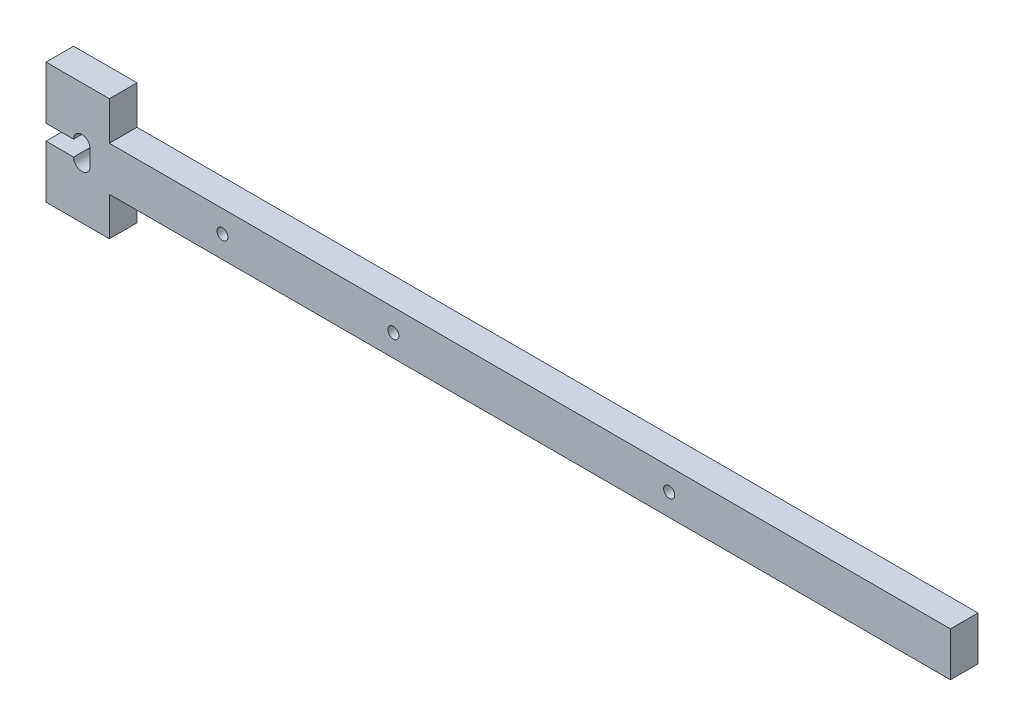
ISO-10303-21;
HEADER;
FILE_DESCRIPTION(('STEP AP214'),'2;1');
FILE_NAME('part.step','',(''),(''),'','','');
FILE_SCHEMA(('AUTOMOTIVE_DESIGN { 1 0 10303 214 1 1 1 1 }'));
ENDSEC;
DATA;
#1=APPLICATION_CONTEXT('core data for automotive mechanical design processes');
#2=APPLICATION_PROTOCOL_DEFINITION('international standard','automotive_design',2000,#1);
#3=PRODUCT_CONTEXT('',#1,'mechanical');
#4=PRODUCT('Part','Part','',(#3));
#5=PRODUCT_RELATED_PRODUCT_CATEGORY('part','',(#4));
#6=PRODUCT_DEFINITION_FORMATION('','',#4);
#7=PRODUCT_DEFINITION_CONTEXT('part definition',#1,'design');
#8=PRODUCT_DEFINITION('design','',#6,#7);
#9=PRODUCT_DEFINITION_SHAPE('','',#8);
#10=(LENGTH_UNIT() NAMED_UNIT(*) SI_UNIT(.MILLI.,.METRE.));
#11=(NAMED_UNIT(*) PLANE_ANGLE_UNIT() SI_UNIT($,.RADIAN.));
#12=(NAMED_UNIT(*) SI_UNIT($,.STERADIAN.) SOLID_ANGLE_UNIT());
#13=UNCERTAINTY_MEASURE_WITH_UNIT(LENGTH_MEASURE(1.E-05),#10,'distance_accuracy_value','');
#14=(GEOMETRIC_REPRESENTATION_CONTEXT(3) GLOBAL_UNCERTAINTY_ASSIGNED_CONTEXT((#13)) GLOBAL_UNIT_ASSIGNED_CONTEXT((#10,
#11,#12)) REPRESENTATION_CONTEXT('',''));
#15=CARTESIAN_POINT('',(0.,0.,0.));
#16=DIRECTION('',(0.,0.,1.));
#17=DIRECTION('',(1.,0.,0.));
#18=AXIS2_PLACEMENT_3D('',#15,#16,#17);
#19=CARTESIAN_POINT('',(2568.66153197921,4659.23440091256,5.));
#20=DIRECTION('',(0.,0.,-1.));
#21=DIRECTION('',(-1.,0.,0.));
#22=AXIS2_PLACEMENT_3D('',#19,#20,#21);
#23=CYLINDRICAL_SURFACE('',#22,1.50000000000006);
#24=CARTESIAN_POINT('',(2568.66153197921,4659.23440091256,0.));
#25=DIRECTION('',(0.,0.,1.));
#26=DIRECTION('',(1.,0.,0.));
#27=AXIS2_PLACEMENT_3D('',#24,#25,#26);
#28=CIRCLE('',#27,1.50000000000006);
#29=CARTESIAN_POINT('',(2567.16153197921,4659.23440091256,0.));
#30=VERTEX_POINT('',#29);
#31=CARTESIAN_POINT('',(2570.16153197921,4659.23440091256,0.));
#32=VERTEX_POINT('',#31);
#33=EDGE_CURVE('E174',#30,#32,#28,.T.);
#34=ORIENTED_EDGE('',*,*,#33,.F.);
#35=DIRECTION('',(0.,0.,-1.));
#36=VECTOR('',#35,1.);
#37=CARTESIAN_POINT('',(2567.16153197921,4659.23440091256,5.));
#38=LINE('',#37,#36);
#39=CARTESIAN_POINT('',(2567.16153197921,4659.23440091256,5.));
#40=VERTEX_POINT('',#39);
#41=EDGE_CURVE('E11',#40,#30,#38,.T.);
#42=ORIENTED_EDGE('',*,*,#41,.F.);
#43=CARTESIAN_POINT('',(2568.66153197921,4659.23440091256,5.));
#44=DIRECTION('',(0.,0.,1.));
#45=DIRECTION('',(1.,0.,0.));
#46=AXIS2_PLACEMENT_3D('',#43,#44,#45);
#47=CIRCLE('',#46,1.50000000000006);
#48=CARTESIAN_POINT('',(2570.16153197921,4659.23440091256,5.));
#49=VERTEX_POINT('',#48);
#50=EDGE_CURVE('E257',#40,#49,#47,.T.);
#51=ORIENTED_EDGE('',*,*,#50,.T.);
#52=DIRECTION('',(0.,0.,-1.));
#53=VECTOR('',#52,1.);
#54=CARTESIAN_POINT('',(2570.16153197921,4659.23440091256,5.));
#55=LINE('',#54,#53);
#56=EDGE_CURVE('E52',#49,#32,#55,.T.);
#57=ORIENTED_EDGE('',*,*,#56,.T.);
#58=EDGE_LOOP('',(#34,#42,#51,#57));
#59=FACE_BOUND('',#58,.T.);
#60=ADVANCED_FACE('F35',(#59),#23,.F.);
#61=CARTESIAN_POINT('',(0.,4659.23440091256,5.));
#62=DIRECTION('',(0.,1.,0.));
#63=DIRECTION('',(0.,0.,1.));
#64=AXIS2_PLACEMENT_3D('',#61,#62,#63);
#65=PLANE('',#64);
#66=DIRECTION('',(1.,0.,0.));
#67=VECTOR('',#66,1.);
#68=CARTESIAN_POINT('',(0.,4659.23440091256,0.));
#69=LINE('',#68,#67);
#70=CARTESIAN_POINT('',(2562.16153197921,4659.23440091256,0.));
#71=VERTEX_POINT('',#70);
#72=EDGE_CURVE('E176',#71,#30,#69,.T.);
#73=ORIENTED_EDGE('',*,*,#72,.F.);
#74=DIRECTION('',(0.,0.,-1.));
#75=VECTOR('',#74,1.);
#76=CARTESIAN_POINT('',(2562.16153197921,4659.23440091256,5.));
#77=LINE('',#76,#75);
#78=CARTESIAN_POINT('',(2562.16153197921,4659.23440091256,5.));
#79=VERTEX_POINT('',#78);
#80=EDGE_CURVE('E44',#79,#71,#77,.T.);
#81=ORIENTED_EDGE('',*,*,#80,.F.);
#82=DIRECTION('',(1.,0.,0.));
#83=VECTOR('',#82,1.);
#84=CARTESIAN_POINT('',(0.,4659.23440091256,5.));
#85=LINE('',#84,#83);
#86=EDGE_CURVE('E255',#79,#40,#85,.T.);
#87=ORIENTED_EDGE('',*,*,#86,.T.);
#88=ORIENTED_EDGE('',*,*,#41,.T.);
#89=EDGE_LOOP('',(#73,#81,#87,#88));
#90=FACE_BOUND('',#89,.T.);
#91=ADVANCED_FACE('F242',(#90),#65,.T.);
#92=CARTESIAN_POINT('',(2562.16153197921,0.,5.));
#93=DIRECTION('',(-1.,0.,0.));
#94=DIRECTION('',(0.,0.,1.));
#95=AXIS2_PLACEMENT_3D('',#92,#93,#94);
#96=PLANE('',#95);
#97=DIRECTION('',(0.,1.,0.));
#98=VECTOR('',#97,1.);
#99=CARTESIAN_POINT('',(2562.16153197921,0.,0.));
#100=LINE('',#99,#98);
#101=CARTESIAN_POINT('',(2562.16153197921,4649.6438849136,0.));
#102=VERTEX_POINT('',#101);
#103=EDGE_CURVE('E179',#102,#71,#100,.T.);
#104=ORIENTED_EDGE('',*,*,#103,.F.);
#105=DIRECTION('',(0.,0.,-1.));
#106=VECTOR('',#105,1.);
#107=CARTESIAN_POINT('',(2562.16153197921,4649.6438849136,5.));
#108=LINE('',#107,#106);
#109=CARTESIAN_POINT('',(2562.16153197921,4649.6438849136,5.));
#110=VERTEX_POINT('',#109);
#111=EDGE_CURVE('E231',#110,#102,#108,.T.);
#112=ORIENTED_EDGE('',*,*,#111,.F.);
#113=DIRECTION('',(0.,1.,0.));
#114=VECTOR('',#113,1.);
#115=CARTESIAN_POINT('',(2562.16153197921,0.,5.));
#116=LINE('',#115,#114);
#117=EDGE_CURVE('E238',#110,#79,#116,.T.);
#118=ORIENTED_EDGE('',*,*,#117,.T.);
#119=ORIENTED_EDGE('',*,*,#80,.T.);
#120=EDGE_LOOP('',(#104,#112,#118,#119));
#121=FACE_BOUND('',#120,.T.);
#122=ADVANCED_FACE('F236',(#121),#96,.T.);
#123=CARTESIAN_POINT('',(0.,4649.6438849136,5.));
#124=DIRECTION('',(0.,1.,0.));
#125=DIRECTION('',(0.,0.,1.));
#126=AXIS2_PLACEMENT_3D('',#123,#124,#125);
#127=PLANE('',#126);
#128=DIRECTION('',(1.,0.,0.));
#129=VECTOR('',#128,1.);
#130=CARTESIAN_POINT('',(0.,4649.6438849136,0.));
#131=LINE('',#130,#129);
#132=CARTESIAN_POINT('',(2573.66153197921,4649.6438849136,0.));
#133=VERTEX_POINT('',#132);
#134=EDGE_CURVE('E182',#102,#133,#131,.T.);
#135=ORIENTED_EDGE('',*,*,#134,.T.);
#136=DIRECTION('',(0.,0.,-1.));
#137=VECTOR('',#136,1.);
#138=CARTESIAN_POINT('',(2573.66153197921,4649.6438849136,5.));
#139=LINE('',#138,#137);
#140=CARTESIAN_POINT('',(2573.66153197921,4649.6438849136,5.));
#141=VERTEX_POINT('',#140);
#142=EDGE_CURVE('E228',#141,#133,#139,.T.);
#143=ORIENTED_EDGE('',*,*,#142,.F.);
#144=DIRECTION('',(1.,0.,0.));
#145=VECTOR('',#144,1.);
#146=CARTESIAN_POINT('',(0.,4649.6438849136,5.));
#147=LINE('',#146,#145);
#148=EDGE_CURVE('E251',#110,#141,#147,.T.);
#149=ORIENTED_EDGE('',*,*,#148,.F.);
#150=ORIENTED_EDGE('',*,*,#111,.T.);
#151=EDGE_LOOP('',(#135,#143,#149,#150));
#152=FACE_BOUND('',#151,.T.);
#153=ADVANCED_FACE('F248',(#152),#127,.F.);
#154=CARTESIAN_POINT('',(2573.66153197921,0.,5.));
#155=DIRECTION('',(-1.,0.,0.));
#156=DIRECTION('',(0.,0.,1.));
#157=AXIS2_PLACEMENT_3D('',#154,#155,#156);
#158=PLANE('',#157);
#159=DIRECTION('',(0.,1.,0.));
#160=VECTOR('',#159,1.);
#161=CARTESIAN_POINT('',(2573.66153197921,0.,0.));
#162=LINE('',#161,#160);
#163=CARTESIAN_POINT('',(2573.66153197921,4656.63440091256,0.));
#164=VERTEX_POINT('',#163);
#165=EDGE_CURVE('E186',#133,#164,#162,.T.);
#166=ORIENTED_EDGE('',*,*,#165,.T.);
#167=DIRECTION('',(0.,0.,-1.));
#168=VECTOR('',#167,1.);
#169=CARTESIAN_POINT('',(2573.66153197921,4656.63440091256,5.));
#170=LINE('',#169,#168);
#171=CARTESIAN_POINT('',(2573.66153197921,4656.63440091256,5.));
#172=VERTEX_POINT('',#171);
#173=EDGE_CURVE('E225',#172,#164,#170,.T.);
#174=ORIENTED_EDGE('',*,*,#173,.F.);
#175=DIRECTION('',(0.,1.,0.));
#176=VECTOR('',#175,1.);
#177=CARTESIAN_POINT('',(2573.66153197921,0.,5.));
#178=LINE('',#177,#176);
#179=EDGE_CURVE('E253',#141,#172,#178,.T.);
#180=ORIENTED_EDGE('',*,*,#179,.F.);
#181=ORIENTED_EDGE('',*,*,#142,.T.);
#182=EDGE_LOOP('',(#166,#174,#180,#181));
#183=FACE_BOUND('',#182,.T.);
#184=ADVANCED_FACE('F277',(#183),#158,.F.);
#185=CARTESIAN_POINT('',(0.,4656.63440091256,5.));
#186=DIRECTION('',(0.,1.,0.));
#187=DIRECTION('',(0.,0.,1.));
#188=AXIS2_PLACEMENT_3D('',#185,#186,#187);
#189=PLANE('',#188);
#190=DIRECTION('',(1.,0.,0.));
#191=VECTOR('',#190,1.);
#192=CARTESIAN_POINT('',(0.,4656.63440091256,0.));
#193=LINE('',#192,#191);
#194=CARTESIAN_POINT('',(2726.16153197921,4656.63440091256,0.));
#195=VERTEX_POINT('',#194);
#196=EDGE_CURVE('E189',#164,#195,#193,.T.);
#197=ORIENTED_EDGE('',*,*,#196,.T.);
#198=DIRECTION('',(0.,0.,-1.));
#199=VECTOR('',#198,1.);
#200=CARTESIAN_POINT('',(2726.16153197921,4656.63440091256,5.));
#201=LINE('',#200,#199);
#202=CARTESIAN_POINT('',(2726.16153197921,4656.63440091256,5.));
#203=VERTEX_POINT('',#202);
#204=EDGE_CURVE('E222',#203,#195,#201,.T.);
#205=ORIENTED_EDGE('',*,*,#204,.F.);
#206=DIRECTION('',(1.,0.,0.));
#207=VECTOR('',#206,1.);
#208=CARTESIAN_POINT('',(0.,4656.63440091256,5.));
#209=LINE('',#208,#207);
#210=EDGE_CURVE('E271',#172,#203,#209,.T.);
#211=ORIENTED_EDGE('',*,*,#210,.F.);
#212=ORIENTED_EDGE('',*,*,#173,.T.);
#213=EDGE_LOOP('',(#197,#205,#211,#212));
#214=FACE_BOUND('',#213,.T.);
#215=ADVANCED_FACE('F279',(#214),#189,.F.);
#216=CARTESIAN_POINT('',(2726.16153197973,3.02492349394644E-10,5.));
#217=DIRECTION('',(-1.,-1.10959070416849E-13,0.));
#218=DIRECTION('',(1.10959070416849E-13,-1.,0.));
#219=AXIS2_PLACEMENT_3D('',#216,#217,#218);
#220=PLANE('',#219);
#221=DIRECTION('',(-1.10959070416849E-13,1.,0.));
#222=VECTOR('',#221,1.);
#223=CARTESIAN_POINT('',(2726.16153197973,3.02492349394644E-10,0.));
#224=LINE('',#223,#222);
#225=CARTESIAN_POINT('',(2726.16153197921,4664.63462726327,0.));
#226=VERTEX_POINT('',#225);
#227=EDGE_CURVE('E192',#195,#226,#224,.T.);
#228=ORIENTED_EDGE('',*,*,#227,.T.);
#229=DIRECTION('',(0.,0.,-1.));
#230=VECTOR('',#229,1.);
#231=CARTESIAN_POINT('',(2726.16153197921,4664.63462726327,5.));
#232=LINE('',#231,#230);
#233=CARTESIAN_POINT('',(2726.16153197921,4664.63462726327,5.));
#234=VERTEX_POINT('',#233);
#235=EDGE_CURVE('E220',#234,#226,#232,.T.);
#236=ORIENTED_EDGE('',*,*,#235,.F.);
#237=DIRECTION('',(-1.10959070416849E-13,1.,0.));
#238=VECTOR('',#237,1.);
#239=CARTESIAN_POINT('',(2726.16153197973,3.02492349394644E-10,5.));
#240=LINE('',#239,#238);
#241=EDGE_CURVE('E269',#203,#234,#240,.T.);
#242=ORIENTED_EDGE('',*,*,#241,.F.);
#243=ORIENTED_EDGE('',*,*,#204,.T.);
#244=EDGE_LOOP('',(#228,#236,#242,#243));
#245=FACE_BOUND('',#244,.T.);
#246=ADVANCED_FACE('F281',(#245),#220,.F.);
#247=CARTESIAN_POINT('',(0.5729210615684,4664.96936625034,5.));
#248=DIRECTION('',(0.000122813466127471,0.999999992458426,0.));
#249=DIRECTION('',(-0.999999992458426,0.000122813466127471,0.));
#250=AXIS2_PLACEMENT_3D('',#247,#248,#249);
#251=PLANE('',#250);
#252=DIRECTION('',(0.999999992458426,-0.000122813466127471,0.));
#253=VECTOR('',#252,1.);
#254=CARTESIAN_POINT('',(0.5729210615684,4664.96936625034,0.));
#255=LINE('',#254,#253);
#256=CARTESIAN_POINT('',(2573.66153197921,4664.65335631699,0.));
#257=VERTEX_POINT('',#256);
#258=EDGE_CURVE('E195',#257,#226,#255,.T.);
#259=ORIENTED_EDGE('',*,*,#258,.F.);
#260=DIRECTION('',(0.,0.,-1.));
#261=VECTOR('',#260,1.);
#262=CARTESIAN_POINT('',(2573.66153197921,4664.65335631699,5.));
#263=LINE('',#262,#261);
#264=CARTESIAN_POINT('',(2573.66153197921,4664.65335631699,5.));
#265=VERTEX_POINT('',#264);
#266=EDGE_CURVE('E218',#265,#257,#263,.T.);
#267=ORIENTED_EDGE('',*,*,#266,.F.);
#268=DIRECTION('',(0.999999992458426,-0.000122813466127471,0.));
#269=VECTOR('',#268,1.);
#270=CARTESIAN_POINT('',(0.5729210615684,4664.96936625034,5.));
#271=LINE('',#270,#269);
#272=EDGE_CURVE('E264',#265,#234,#271,.T.);
#273=ORIENTED_EDGE('',*,*,#272,.T.);
#274=ORIENTED_EDGE('',*,*,#235,.T.);
#275=EDGE_LOOP('',(#259,#267,#273,#274));
#276=FACE_BOUND('',#275,.T.);
#277=ADVANCED_FACE('F288',(#276),#251,.T.);
#278=CARTESIAN_POINT('',(2573.66153197921,0.,5.));
#279=DIRECTION('',(-1.,0.,0.));
#280=DIRECTION('',(0.,0.,1.));
#281=AXIS2_PLACEMENT_3D('',#278,#279,#280);
#282=PLANE('',#281);
#283=DIRECTION('',(0.,1.,0.));
#284=VECTOR('',#283,1.);
#285=CARTESIAN_POINT('',(2573.66153197921,0.,0.));
#286=LINE('',#285,#284);
#287=CARTESIAN_POINT('',(2573.66153197921,4671.6438849136,0.));
#288=VERTEX_POINT('',#287);
#289=EDGE_CURVE('E198',#257,#288,#286,.T.);
#290=ORIENTED_EDGE('',*,*,#289,.T.);
#291=DIRECTION('',(0.,0.,-1.));
#292=VECTOR('',#291,1.);
#293=CARTESIAN_POINT('',(2573.66153197921,4671.6438849136,5.));
#294=LINE('',#293,#292);
#295=CARTESIAN_POINT('',(2573.66153197921,4671.6438849136,5.));
#296=VERTEX_POINT('',#295);
#297=EDGE_CURVE('E216',#296,#288,#294,.T.);
#298=ORIENTED_EDGE('',*,*,#297,.F.);
#299=DIRECTION('',(0.,1.,0.));
#300=VECTOR('',#299,1.);
#301=CARTESIAN_POINT('',(2573.66153197921,0.,5.));
#302=LINE('',#301,#300);
#303=EDGE_CURVE('E262',#265,#296,#302,.T.);
#304=ORIENTED_EDGE('',*,*,#303,.F.);
#305=ORIENTED_EDGE('',*,*,#266,.T.);
#306=EDGE_LOOP('',(#290,#298,#304,#305));
#307=FACE_BOUND('',#306,.T.);
#308=ADVANCED_FACE('F291',(#307),#282,.F.);
#309=CARTESIAN_POINT('',(3.60804633313439E-10,4671.6438849138,5.));
#310=DIRECTION('',(0.,1.,0.));
#311=DIRECTION('',(-1.,0.,0.));
#312=AXIS2_PLACEMENT_3D('',#309,#310,#311);
#313=PLANE('',#312);
#314=DIRECTION('',(1.,0.,0.));
#315=VECTOR('',#314,1.);
#316=CARTESIAN_POINT('',(3.60804633313439E-10,4671.6438849138,0.));
#317=LINE('',#316,#315);
#318=CARTESIAN_POINT('',(2562.16153197921,4671.6438849136,0.));
#319=VERTEX_POINT('',#318);
#320=EDGE_CURVE('E201',#319,#288,#317,.T.);
#321=ORIENTED_EDGE('',*,*,#320,.F.);
#322=DIRECTION('',(0.,0.,-1.));
#323=VECTOR('',#322,1.);
#324=CARTESIAN_POINT('',(2562.16153197921,4671.6438849136,5.));
#325=LINE('',#324,#323);
#326=CARTESIAN_POINT('',(2562.16153197921,4671.6438849136,5.));
#327=VERTEX_POINT('',#326);
#328=EDGE_CURVE('E214',#327,#319,#325,.T.);
#329=ORIENTED_EDGE('',*,*,#328,.F.);
#330=DIRECTION('',(1.,0.,0.));
#331=VECTOR('',#330,1.);
#332=CARTESIAN_POINT('',(3.60804633313439E-10,4671.6438849138,5.));
#333=LINE('',#332,#331);
#334=EDGE_CURVE('E259',#327,#296,#333,.T.);
#335=ORIENTED_EDGE('',*,*,#334,.T.);
#336=ORIENTED_EDGE('',*,*,#297,.T.);
#337=EDGE_LOOP('',(#321,#329,#335,#336));
#338=FACE_BOUND('',#337,.T.);
#339=ADVANCED_FACE('F293',(#338),#313,.T.);
#340=CARTESIAN_POINT('',(2562.16153197921,4662.03440091256,0.));
#341=VERTEX_POINT('',#340);
#342=EDGE_CURVE('E183',#341,#319,#100,.T.);
#343=ORIENTED_EDGE('',*,*,#342,.F.);
#344=DIRECTION('',(0.,0.,-1.));
#345=VECTOR('',#344,1.);
#346=CARTESIAN_POINT('',(2562.16153197921,4662.03440091256,5.));
#347=LINE('',#346,#345);
#348=CARTESIAN_POINT('',(2562.16153197921,4662.03440091256,5.));
#349=VERTEX_POINT('',#348);
#350=EDGE_CURVE('E157',#349,#341,#347,.T.);
#351=ORIENTED_EDGE('',*,*,#350,.F.);
#352=EDGE_CURVE('E147',#349,#327,#116,.T.);
#353=ORIENTED_EDGE('',*,*,#352,.T.);
#354=ORIENTED_EDGE('',*,*,#328,.T.);
#355=EDGE_LOOP('',(#343,#351,#353,#354));
#356=FACE_BOUND('',#355,.T.);
#357=ADVANCED_FACE('F296',(#356),#96,.T.);
#358=CARTESIAN_POINT('',(0.,4662.03440091256,5.));
#359=DIRECTION('',(0.,1.,0.));
#360=DIRECTION('',(0.,0.,1.));
#361=AXIS2_PLACEMENT_3D('',#358,#359,#360);
#362=PLANE('',#361);
#363=DIRECTION('',(1.,0.,0.));
#364=VECTOR('',#363,1.);
#365=CARTESIAN_POINT('',(0.,4662.03440091256,0.));
#366=LINE('',#365,#364);
#367=CARTESIAN_POINT('',(2567.16153197921,4662.03440091256,0.));
#368=VERTEX_POINT('',#367);
#369=EDGE_CURVE('E154',#341,#368,#366,.T.);
#370=ORIENTED_EDGE('',*,*,#369,.T.);
#371=DIRECTION('',(0.,0.,-1.));
#372=VECTOR('',#371,1.);
#373=CARTESIAN_POINT('',(2567.16153197921,4662.03440091256,5.));
#374=LINE('',#373,#372);
#375=CARTESIAN_POINT('',(2567.16153197921,4662.03440091256,5.));
#376=VERTEX_POINT('',#375);
#377=EDGE_CURVE('E151',#376,#368,#374,.T.);
#378=ORIENTED_EDGE('',*,*,#377,.F.);
#379=DIRECTION('',(1.,0.,0.));
#380=VECTOR('',#379,1.);
#381=CARTESIAN_POINT('',(0.,4662.03440091256,5.));
#382=LINE('',#381,#380);
#383=EDGE_CURVE('E139',#349,#376,#382,.T.);
#384=ORIENTED_EDGE('',*,*,#383,.F.);
#385=ORIENTED_EDGE('',*,*,#350,.T.);
#386=EDGE_LOOP('',(#370,#378,#384,#385));
#387=FACE_BOUND('',#386,.T.);
#388=ADVANCED_FACE('F152',(#387),#362,.F.);
#389=CARTESIAN_POINT('',(2568.66153197921,4662.03440091256,5.));
#390=DIRECTION('',(0.,0.,-1.));
#391=DIRECTION('',(-1.,0.,0.));
#392=AXIS2_PLACEMENT_3D('',#389,#390,#391);
#393=CYLINDRICAL_SURFACE('',#392,1.50000000000006);
#394=CARTESIAN_POINT('',(2568.66153197921,4662.03440091256,0.));
#395=DIRECTION('',(0.,0.,1.));
#396=DIRECTION('',(1.,0.,0.));
#397=AXIS2_PLACEMENT_3D('',#394,#395,#396);
#398=CIRCLE('',#397,1.50000000000006);
#399=CARTESIAN_POINT('',(2570.16153197921,4662.03440091256,0.));
#400=VERTEX_POINT('',#399);
#401=EDGE_CURVE('E205',#400,#368,#398,.T.);
#402=ORIENTED_EDGE('',*,*,#401,.F.);
#403=DIRECTION('',(0.,0.,-1.));
#404=VECTOR('',#403,1.);
#405=CARTESIAN_POINT('',(2570.16153197921,4662.03440091256,5.));
#406=LINE('',#405,#404);
#407=CARTESIAN_POINT('',(2570.16153197921,4662.03440091256,5.));
#408=VERTEX_POINT('',#407);
#409=EDGE_CURVE('E95',#408,#400,#406,.T.);
#410=ORIENTED_EDGE('',*,*,#409,.F.);
#411=CARTESIAN_POINT('',(2568.66153197921,4662.03440091256,5.));
#412=DIRECTION('',(0.,0.,1.));
#413=DIRECTION('',(1.,0.,0.));
#414=AXIS2_PLACEMENT_3D('',#411,#412,#413);
#415=CIRCLE('',#414,1.50000000000006);
#416=EDGE_CURVE('E144',#408,#376,#415,.T.);
#417=ORIENTED_EDGE('',*,*,#416,.T.);
#418=ORIENTED_EDGE('',*,*,#377,.T.);
#419=EDGE_LOOP('',(#402,#410,#417,#418));
#420=FACE_BOUND('',#419,.T.);
#421=ADVANCED_FACE('F159',(#420),#393,.F.);
#422=CARTESIAN_POINT('',(2625.16153197921,4660.63911182301,5.));
#423=DIRECTION('',(0.,0.,-1.));
#424=DIRECTION('',(-1.,0.,0.));
#425=AXIS2_PLACEMENT_3D('',#422,#423,#424);
#426=CYLINDRICAL_SURFACE('',#425,0.99999999999989);
#427=CARTESIAN_POINT('',(2625.16153197921,4660.63911182301,5.));
#428=DIRECTION('',(0.,0.,1.));
#429=DIRECTION('',(1.,0.,0.));
#430=AXIS2_PLACEMENT_3D('',#427,#428,#429);
#431=CIRCLE('',#430,0.99999999999989);
#432=CARTESIAN_POINT('',(2626.16153197921,4660.63911182301,5.));
#433=VERTEX_POINT('',#432);
#434=EDGE_CURVE('E474',#433,#433,#431,.T.);
#435=ORIENTED_EDGE('',*,*,#434,.T.);
#436=EDGE_LOOP('',(#435));
#437=FACE_BOUND('',#436,.T.);
#438=CARTESIAN_POINT('',(2625.16153197921,4660.63911182301,0.));
#439=DIRECTION('',(0.,0.,1.));
#440=DIRECTION('',(1.,0.,0.));
#441=AXIS2_PLACEMENT_3D('',#438,#439,#440);
#442=CIRCLE('',#441,0.99999999999989);
#443=CARTESIAN_POINT('',(2626.16153197921,4660.63911182301,0.));
#444=VERTEX_POINT('',#443);
#445=EDGE_CURVE('E171',#444,#444,#442,.T.);
#446=ORIENTED_EDGE('',*,*,#445,.F.);
#447=EDGE_LOOP('',(#446));
#448=FACE_BOUND('',#447,.T.);
#449=ADVANCED_FACE('F314',(#437,#448),#426,.F.);
#450=CARTESIAN_POINT('',(2594.16153197921,4660.63911182301,5.));
#451=DIRECTION('',(0.,0.,-1.));
#452=DIRECTION('',(-1.,0.,0.));
#453=AXIS2_PLACEMENT_3D('',#450,#451,#452);
#454=CYLINDRICAL_SURFACE('',#453,0.99999999999989);
#455=CARTESIAN_POINT('',(2594.16153197921,4660.63911182301,5.));
#456=DIRECTION('',(0.,0.,1.));
#457=DIRECTION('',(1.,0.,0.));
#458=AXIS2_PLACEMENT_3D('',#455,#456,#457);
#459=CIRCLE('',#458,0.99999999999989);
#460=CARTESIAN_POINT('',(2595.16153197921,4660.63911182301,5.));
#461=VERTEX_POINT('',#460);
#462=EDGE_CURVE('E328',#461,#461,#459,.T.);
#463=ORIENTED_EDGE('',*,*,#462,.T.);
#464=EDGE_LOOP('',(#463));
#465=FACE_BOUND('',#464,.T.);
#466=CARTESIAN_POINT('',(2594.16153197921,4660.63911182301,0.));
#467=DIRECTION('',(0.,0.,1.));
#468=DIRECTION('',(1.,0.,0.));
#469=AXIS2_PLACEMENT_3D('',#466,#467,#468);
#470=CIRCLE('',#469,0.99999999999989);
#471=CARTESIAN_POINT('',(2595.16153197921,4660.63911182301,0.));
#472=VERTEX_POINT('',#471);
#473=EDGE_CURVE('E168',#472,#472,#470,.T.);
#474=ORIENTED_EDGE('',*,*,#473,.F.);
#475=EDGE_LOOP('',(#474));
#476=FACE_BOUND('',#475,.T.);
#477=ADVANCED_FACE('F316',(#465,#476),#454,.F.);
#478=CARTESIAN_POINT('',(2675.16153197921,4660.63911182301,5.));
#479=DIRECTION('',(0.,0.,-1.));
#480=DIRECTION('',(-1.,0.,0.));
#481=AXIS2_PLACEMENT_3D('',#478,#479,#480);
#482=CYLINDRICAL_SURFACE('',#481,0.99999999999989);
#483=CARTESIAN_POINT('',(2675.16153197921,4660.63911182301,5.));
#484=DIRECTION('',(0.,0.,1.));
#485=DIRECTION('',(1.,0.,0.));
#486=AXIS2_PLACEMENT_3D('',#483,#484,#485);
#487=CIRCLE('',#486,0.99999999999989);
#488=CARTESIAN_POINT('',(2676.16153197921,4660.63911182301,5.));
#489=VERTEX_POINT('',#488);
#490=EDGE_CURVE('E210',#489,#489,#487,.T.);
#491=ORIENTED_EDGE('',*,*,#490,.T.);
#492=EDGE_LOOP('',(#491));
#493=FACE_BOUND('',#492,.T.);
#494=CARTESIAN_POINT('',(2675.16153197921,4660.63911182301,0.));
#495=DIRECTION('',(0.,0.,1.));
#496=DIRECTION('',(1.,0.,0.));
#497=AXIS2_PLACEMENT_3D('',#494,#495,#496);
#498=CIRCLE('',#497,0.99999999999989);
#499=CARTESIAN_POINT('',(2676.16153197921,4660.63911182301,0.));
#500=VERTEX_POINT('',#499);
#501=EDGE_CURVE('E165',#500,#500,#498,.T.);
#502=ORIENTED_EDGE('',*,*,#501,.F.);
#503=EDGE_LOOP('',(#502));
#504=FACE_BOUND('',#503,.T.);
#505=ADVANCED_FACE('F37',(#493,#504),#482,.F.);
#506=CARTESIAN_POINT('',(2570.16153197921,0.,5.));
#507=DIRECTION('',(-1.,0.,0.));
#508=DIRECTION('',(0.,0.,1.));
#509=AXIS2_PLACEMENT_3D('',#506,#507,#508);
#510=PLANE('',#509);
#511=DIRECTION('',(0.,1.,0.));
#512=VECTOR('',#511,1.);
#513=CARTESIAN_POINT('',(2570.16153197921,0.,0.));
#514=LINE('',#513,#512);
#515=EDGE_CURVE('E207',#32,#400,#514,.T.);
#516=ORIENTED_EDGE('',*,*,#515,.F.);
#517=ORIENTED_EDGE('',*,*,#56,.F.);
#518=DIRECTION('',(0.,1.,0.));
#519=VECTOR('',#518,1.);
#520=CARTESIAN_POINT('',(2570.16153197921,0.,5.));
#521=LINE('',#520,#519);
#522=EDGE_CURVE('E160',#49,#408,#521,.T.);
#523=ORIENTED_EDGE('',*,*,#522,.T.);
#524=ORIENTED_EDGE('',*,*,#409,.T.);
#525=EDGE_LOOP('',(#516,#517,#523,#524));
#526=FACE_BOUND('',#525,.T.);
#527=ADVANCED_FACE('F323',(#526),#510,.T.);
#528=CARTESIAN_POINT('',(0.,0.,5.));
#529=DIRECTION('',(0.,0.,1.));
#530=DIRECTION('',(1.,0.,0.));
#531=AXIS2_PLACEMENT_3D('',#528,#529,#530);
#532=PLANE('',#531);
#533=ORIENTED_EDGE('',*,*,#490,.F.);
#534=EDGE_LOOP('',(#533));
#535=FACE_BOUND('',#534,.T.);
#536=ORIENTED_EDGE('',*,*,#462,.F.);
#537=EDGE_LOOP('',(#536));
#538=FACE_BOUND('',#537,.T.);
#539=ORIENTED_EDGE('',*,*,#434,.F.);
#540=EDGE_LOOP('',(#539));
#541=FACE_BOUND('',#540,.T.);
#542=ORIENTED_EDGE('',*,*,#50,.F.);
#543=ORIENTED_EDGE('',*,*,#86,.F.);
#544=ORIENTED_EDGE('',*,*,#117,.F.);
#545=ORIENTED_EDGE('',*,*,#148,.T.);
#546=ORIENTED_EDGE('',*,*,#179,.T.);
#547=ORIENTED_EDGE('',*,*,#210,.T.);
#548=ORIENTED_EDGE('',*,*,#241,.T.);
#549=ORIENTED_EDGE('',*,*,#272,.F.);
#550=ORIENTED_EDGE('',*,*,#303,.T.);
#551=ORIENTED_EDGE('',*,*,#334,.F.);
#552=ORIENTED_EDGE('',*,*,#352,.F.);
#553=ORIENTED_EDGE('',*,*,#383,.T.);
#554=ORIENTED_EDGE('',*,*,#416,.F.);
#555=ORIENTED_EDGE('',*,*,#522,.F.);
#556=EDGE_LOOP('',(#542,#543,#544,#545,#546,#547,#548,#549,#550,#551,#552,#553,#554,#555));
#557=FACE_BOUND('',#556,.T.);
#558=ADVANCED_FACE('F141',(#535,#538,#541,#557),#532,.T.);
#559=CARTESIAN_POINT('',(0.,0.,0.));
#560=DIRECTION('',(0.,0.,1.));
#561=DIRECTION('',(1.,0.,0.));
#562=AXIS2_PLACEMENT_3D('',#559,#560,#561);
#563=PLANE('',#562);
#564=ORIENTED_EDGE('',*,*,#501,.T.);
#565=EDGE_LOOP('',(#564));
#566=FACE_BOUND('',#565,.T.);
#567=ORIENTED_EDGE('',*,*,#473,.T.);
#568=EDGE_LOOP('',(#567));
#569=FACE_BOUND('',#568,.T.);
#570=ORIENTED_EDGE('',*,*,#445,.T.);
#571=EDGE_LOOP('',(#570));
#572=FACE_BOUND('',#571,.T.);
#573=ORIENTED_EDGE('',*,*,#33,.T.);
#574=ORIENTED_EDGE('',*,*,#515,.T.);
#575=ORIENTED_EDGE('',*,*,#401,.T.);
#576=ORIENTED_EDGE('',*,*,#369,.F.);
#577=ORIENTED_EDGE('',*,*,#342,.T.);
#578=ORIENTED_EDGE('',*,*,#320,.T.);
#579=ORIENTED_EDGE('',*,*,#289,.F.);
#580=ORIENTED_EDGE('',*,*,#258,.T.);
#581=ORIENTED_EDGE('',*,*,#227,.F.);
#582=ORIENTED_EDGE('',*,*,#196,.F.);
#583=ORIENTED_EDGE('',*,*,#165,.F.);
#584=ORIENTED_EDGE('',*,*,#134,.F.);
#585=ORIENTED_EDGE('',*,*,#103,.T.);
#586=ORIENTED_EDGE('',*,*,#72,.T.);
#587=EDGE_LOOP('',(#573,#574,#575,#576,#577,#578,#579,#580,#581,#582,#583,#584,#585,#586));
#588=FACE_BOUND('',#587,.T.);
#589=ADVANCED_FACE('F245',(#566,#569,#572,#588),#563,.F.);
#590=CLOSED_SHELL('',(#60,#91,#122,#153,#184,#215,#246,#277,#308,#339,#357,#388,#421,#449,#477,
#505,#527,#558,#589));
#591=MANIFOLD_SOLID_BREP('B2',#590);
#592=ADVANCED_BREP_SHAPE_REPRESENTATION('',(#18,#591),#14);
#593=SHAPE_DEFINITION_REPRESENTATION(#9,#592);
ENDSEC;
END-ISO-10303-21;
